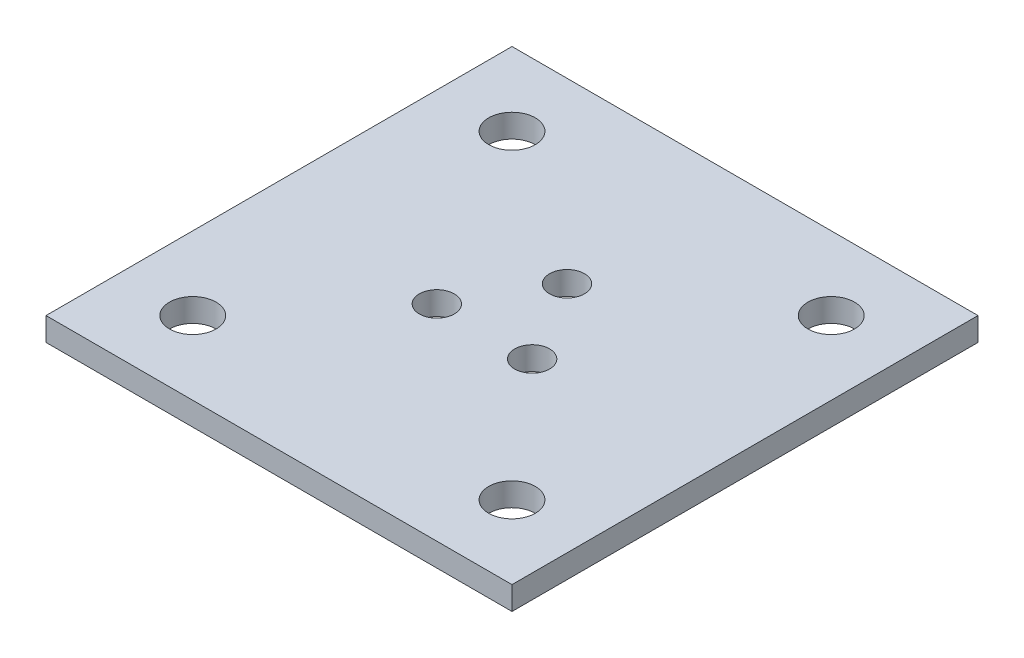
ISO-10303-21;
HEADER;
FILE_DESCRIPTION(('STEP AP214'),'2;1');
FILE_NAME('part.step','',(''),(''),'','','');
FILE_SCHEMA(('AUTOMOTIVE_DESIGN { 1 0 10303 214 1 1 1 1 }'));
ENDSEC;
DATA;
#1=APPLICATION_CONTEXT('core data for automotive mechanical design processes');
#2=APPLICATION_PROTOCOL_DEFINITION('international standard','automotive_design',2000,#1);
#3=PRODUCT_CONTEXT('',#1,'mechanical');
#4=PRODUCT('Part','Part','',(#3));
#5=PRODUCT_RELATED_PRODUCT_CATEGORY('part','',(#4));
#6=PRODUCT_DEFINITION_FORMATION('','',#4);
#7=PRODUCT_DEFINITION_CONTEXT('part definition',#1,'design');
#8=PRODUCT_DEFINITION('design','',#6,#7);
#9=PRODUCT_DEFINITION_SHAPE('','',#8);
#10=(LENGTH_UNIT() NAMED_UNIT(*) SI_UNIT(.MILLI.,.METRE.));
#11=(NAMED_UNIT(*) PLANE_ANGLE_UNIT() SI_UNIT($,.RADIAN.));
#12=(NAMED_UNIT(*) SI_UNIT($,.STERADIAN.) SOLID_ANGLE_UNIT());
#13=UNCERTAINTY_MEASURE_WITH_UNIT(LENGTH_MEASURE(1.E-05),#10,'distance_accuracy_value','');
#14=(GEOMETRIC_REPRESENTATION_CONTEXT(3) GLOBAL_UNCERTAINTY_ASSIGNED_CONTEXT((#13)) GLOBAL_UNIT_ASSIGNED_CONTEXT((#10,
#11,#12)) REPRESENTATION_CONTEXT('',''));
#15=CARTESIAN_POINT('',(0.,0.,0.));
#16=DIRECTION('',(0.,0.,1.));
#17=DIRECTION('',(1.,0.,0.));
#18=AXIS2_PLACEMENT_3D('',#15,#16,#17);
#19=CARTESIAN_POINT('',(31.75,3.175,31.75));
#20=DIRECTION('',(-1.,0.,0.));
#21=DIRECTION('',(0.,0.,1.));
#22=AXIS2_PLACEMENT_3D('',#19,#20,#21);
#23=PLANE('',#22);
#24=DIRECTION('',(0.,0.,-1.));
#25=VECTOR('',#24,1.);
#26=CARTESIAN_POINT('',(31.75,0.,31.75));
#27=LINE('',#26,#25);
#28=CARTESIAN_POINT('',(31.75,0.,31.75));
#29=VERTEX_POINT('',#28);
#30=CARTESIAN_POINT('',(31.75,0.,-31.75));
#31=VERTEX_POINT('',#30);
#32=EDGE_CURVE('E96',#29,#31,#27,.T.);
#33=ORIENTED_EDGE('',*,*,#32,.T.);
#34=DIRECTION('',(0.,-1.,0.));
#35=VECTOR('',#34,1.);
#36=CARTESIAN_POINT('',(31.75,3.175,-31.75));
#37=LINE('',#36,#35);
#38=CARTESIAN_POINT('',(31.75,3.175,-31.75));
#39=VERTEX_POINT('',#38);
#40=EDGE_CURVE('E11',#39,#31,#37,.T.);
#41=ORIENTED_EDGE('',*,*,#40,.F.);
#42=DIRECTION('',(0.,0.,-1.));
#43=VECTOR('',#42,1.);
#44=CARTESIAN_POINT('',(31.75,3.175,31.75));
#45=LINE('',#44,#43);
#46=CARTESIAN_POINT('',(31.75,3.175,31.75));
#47=VERTEX_POINT('',#46);
#48=EDGE_CURVE('E84',#47,#39,#45,.T.);
#49=ORIENTED_EDGE('',*,*,#48,.F.);
#50=DIRECTION('',(0.,-1.,0.));
#51=VECTOR('',#50,1.);
#52=CARTESIAN_POINT('',(31.75,3.175,31.75));
#53=LINE('',#52,#51);
#54=EDGE_CURVE('E92',#47,#29,#53,.T.);
#55=ORIENTED_EDGE('',*,*,#54,.T.);
#56=EDGE_LOOP('',(#33,#41,#49,#55));
#57=FACE_BOUND('',#56,.T.);
#58=ADVANCED_FACE('F33',(#57),#23,.F.);
#59=CARTESIAN_POINT('',(-31.75,3.175,-31.75));
#60=DIRECTION('',(0.,0.,1.));
#61=DIRECTION('',(1.,0.,0.));
#62=AXIS2_PLACEMENT_3D('',#59,#60,#61);
#63=PLANE('',#62);
#64=DIRECTION('',(-1.,0.,0.));
#65=VECTOR('',#64,1.);
#66=CARTESIAN_POINT('',(-31.75,0.,-31.75));
#67=LINE('',#66,#65);
#68=CARTESIAN_POINT('',(-31.75,0.,-31.75));
#69=VERTEX_POINT('',#68);
#70=EDGE_CURVE('E88',#31,#69,#67,.T.);
#71=ORIENTED_EDGE('',*,*,#70,.T.);
#72=DIRECTION('',(0.,-1.,0.));
#73=VECTOR('',#72,1.);
#74=CARTESIAN_POINT('',(-31.75,3.175,-31.75));
#75=LINE('',#74,#73);
#76=CARTESIAN_POINT('',(-31.75,3.175,-31.75));
#77=VERTEX_POINT('',#76);
#78=EDGE_CURVE('E41',#77,#69,#75,.T.);
#79=ORIENTED_EDGE('',*,*,#78,.F.);
#80=DIRECTION('',(-1.,0.,0.));
#81=VECTOR('',#80,1.);
#82=CARTESIAN_POINT('',(-31.75,3.175,-31.75));
#83=LINE('',#82,#81);
#84=EDGE_CURVE('E79',#39,#77,#83,.T.);
#85=ORIENTED_EDGE('',*,*,#84,.F.);
#86=ORIENTED_EDGE('',*,*,#40,.T.);
#87=EDGE_LOOP('',(#71,#79,#85,#86));
#88=FACE_BOUND('',#87,.T.);
#89=ADVANCED_FACE('F87',(#88),#63,.F.);
#90=CARTESIAN_POINT('',(-31.75,3.175,31.75));
#91=DIRECTION('',(1.,0.,0.));
#92=DIRECTION('',(0.,0.,-1.));
#93=AXIS2_PLACEMENT_3D('',#90,#91,#92);
#94=PLANE('',#93);
#95=DIRECTION('',(0.,0.,1.));
#96=VECTOR('',#95,1.);
#97=CARTESIAN_POINT('',(-31.75,0.,31.75));
#98=LINE('',#97,#96);
#99=CARTESIAN_POINT('',(-31.75,0.,31.75));
#100=VERTEX_POINT('',#99);
#101=EDGE_CURVE('E66',#69,#100,#98,.T.);
#102=ORIENTED_EDGE('',*,*,#101,.T.);
#103=DIRECTION('',(0.,-1.,0.));
#104=VECTOR('',#103,1.);
#105=CARTESIAN_POINT('',(-31.75,3.175,31.75));
#106=LINE('',#105,#104);
#107=CARTESIAN_POINT('',(-31.75,3.175,31.75));
#108=VERTEX_POINT('',#107);
#109=EDGE_CURVE('E89',#108,#100,#106,.T.);
#110=ORIENTED_EDGE('',*,*,#109,.F.);
#111=DIRECTION('',(0.,0.,1.));
#112=VECTOR('',#111,1.);
#113=CARTESIAN_POINT('',(-31.75,3.175,31.75));
#114=LINE('',#113,#112);
#115=EDGE_CURVE('E82',#77,#108,#114,.T.);
#116=ORIENTED_EDGE('',*,*,#115,.F.);
#117=ORIENTED_EDGE('',*,*,#78,.T.);
#118=EDGE_LOOP('',(#102,#110,#116,#117));
#119=FACE_BOUND('',#118,.T.);
#120=ADVANCED_FACE('F90',(#119),#94,.F.);
#121=CARTESIAN_POINT('',(-31.75,3.175,31.75));
#122=DIRECTION('',(0.,0.,-1.));
#123=DIRECTION('',(-1.,0.,0.));
#124=AXIS2_PLACEMENT_3D('',#121,#122,#123);
#125=PLANE('',#124);
#126=DIRECTION('',(1.,0.,0.));
#127=VECTOR('',#126,1.);
#128=CARTESIAN_POINT('',(-31.75,0.,31.75));
#129=LINE('',#128,#127);
#130=EDGE_CURVE('E72',#100,#29,#129,.T.);
#131=ORIENTED_EDGE('',*,*,#130,.T.);
#132=ORIENTED_EDGE('',*,*,#54,.F.);
#133=DIRECTION('',(1.,0.,0.));
#134=VECTOR('',#133,1.);
#135=CARTESIAN_POINT('',(-31.75,3.175,31.75));
#136=LINE('',#135,#134);
#137=EDGE_CURVE('E49',#108,#47,#136,.T.);
#138=ORIENTED_EDGE('',*,*,#137,.F.);
#139=ORIENTED_EDGE('',*,*,#109,.T.);
#140=EDGE_LOOP('',(#131,#132,#138,#139));
#141=FACE_BOUND('',#140,.T.);
#142=ADVANCED_FACE('F104',(#141),#125,.F.);
#143=CARTESIAN_POINT('',(0.,3.175,0.));
#144=DIRECTION('',(0.,-1.,0.));
#145=DIRECTION('',(0.,0.,-1.));
#146=AXIS2_PLACEMENT_3D('',#143,#144,#145);
#147=PLANE('',#146);
#148=CARTESIAN_POINT('',(21.75,3.175,-21.75));
#149=DIRECTION('',(0.,1.,0.));
#150=DIRECTION('',(0.,0.,1.));
#151=AXIS2_PLACEMENT_3D('',#148,#149,#150);
#152=CIRCLE('',#151,3.175);
#153=CARTESIAN_POINT('',(21.75,3.175,-18.575));
#154=VERTEX_POINT('',#153);
#155=EDGE_CURVE('E134',#154,#154,#152,.T.);
#156=ORIENTED_EDGE('',*,*,#155,.F.);
#157=EDGE_LOOP('',(#156));
#158=FACE_BOUND('',#157,.T.);
#159=CARTESIAN_POINT('',(21.75,3.175,21.75));
#160=DIRECTION('',(0.,1.,0.));
#161=DIRECTION('',(0.,0.,1.));
#162=AXIS2_PLACEMENT_3D('',#159,#160,#161);
#163=CIRCLE('',#162,3.175);
#164=CARTESIAN_POINT('',(21.75,3.175,24.925));
#165=VERTEX_POINT('',#164);
#166=EDGE_CURVE('E140',#165,#165,#163,.T.);
#167=ORIENTED_EDGE('',*,*,#166,.F.);
#168=EDGE_LOOP('',(#167));
#169=FACE_BOUND('',#168,.T.);
#170=CARTESIAN_POINT('',(-21.75,3.175,21.75));
#171=DIRECTION('',(0.,1.,0.));
#172=DIRECTION('',(0.,0.,1.));
#173=AXIS2_PLACEMENT_3D('',#170,#171,#172);
#174=CIRCLE('',#173,3.175);
#175=CARTESIAN_POINT('',(-21.75,3.175,24.925));
#176=VERTEX_POINT('',#175);
#177=EDGE_CURVE('E146',#176,#176,#174,.T.);
#178=ORIENTED_EDGE('',*,*,#177,.F.);
#179=EDGE_LOOP('',(#178));
#180=FACE_BOUND('',#179,.T.);
#181=CARTESIAN_POINT('',(-21.75,3.175,-21.75));
#182=DIRECTION('',(0.,1.,0.));
#183=DIRECTION('',(0.,0.,1.));
#184=AXIS2_PLACEMENT_3D('',#181,#182,#183);
#185=CIRCLE('',#184,3.175);
#186=CARTESIAN_POINT('',(-21.75,3.175,-18.575));
#187=VERTEX_POINT('',#186);
#188=EDGE_CURVE('E128',#187,#187,#185,.T.);
#189=ORIENTED_EDGE('',*,*,#188,.F.);
#190=EDGE_LOOP('',(#189));
#191=FACE_BOUND('',#190,.T.);
#192=CARTESIAN_POINT('',(0.,3.175,-7.5));
#193=DIRECTION('',(0.,1.,0.));
#194=DIRECTION('',(0.,0.,1.));
#195=AXIS2_PLACEMENT_3D('',#192,#193,#194);
#196=CIRCLE('',#195,2.38125);
#197=CARTESIAN_POINT('',(0.,3.175,-5.11875));
#198=VERTEX_POINT('',#197);
#199=EDGE_CURVE('E123',#198,#198,#196,.T.);
#200=ORIENTED_EDGE('',*,*,#199,.F.);
#201=EDGE_LOOP('',(#200));
#202=FACE_BOUND('',#201,.T.);
#203=CARTESIAN_POINT('',(-6.49519052838272,3.175,3.75000000000033));
#204=DIRECTION('',(0.,1.,0.));
#205=DIRECTION('',(0.,0.,1.));
#206=AXIS2_PLACEMENT_3D('',#203,#204,#205);
#207=CIRCLE('',#206,2.38125);
#208=CARTESIAN_POINT('',(-6.49519052838272,3.175,6.13125000000033));
#209=VERTEX_POINT('',#208);
#210=EDGE_CURVE('E120',#209,#209,#207,.T.);
#211=ORIENTED_EDGE('',*,*,#210,.F.);
#212=EDGE_LOOP('',(#211));
#213=FACE_BOUND('',#212,.T.);
#214=CARTESIAN_POINT('',(6.49519052838386,3.175,3.74999999999966));
#215=DIRECTION('',(0.,1.,0.));
#216=DIRECTION('',(0.,0.,1.));
#217=AXIS2_PLACEMENT_3D('',#214,#215,#216);
#218=CIRCLE('',#217,2.38125);
#219=CARTESIAN_POINT('',(6.49519052838386,3.175,6.13124999999966));
#220=VERTEX_POINT('',#219);
#221=EDGE_CURVE('E113',#220,#220,#218,.T.);
#222=ORIENTED_EDGE('',*,*,#221,.F.);
#223=EDGE_LOOP('',(#222));
#224=FACE_BOUND('',#223,.T.);
#225=ORIENTED_EDGE('',*,*,#48,.T.);
#226=ORIENTED_EDGE('',*,*,#84,.T.);
#227=ORIENTED_EDGE('',*,*,#115,.T.);
#228=ORIENTED_EDGE('',*,*,#137,.T.);
#229=EDGE_LOOP('',(#225,#226,#227,#228));
#230=FACE_BOUND('',#229,.T.);
#231=ADVANCED_FACE('F80',(#158,#169,#180,#191,#202,#213,#224,#230),#147,.F.);
#232=CARTESIAN_POINT('',(0.,0.,0.));
#233=DIRECTION('',(0.,-1.,0.));
#234=DIRECTION('',(0.,0.,-1.));
#235=AXIS2_PLACEMENT_3D('',#232,#233,#234);
#236=PLANE('',#235);
#237=CARTESIAN_POINT('',(21.75,0.,-21.75));
#238=DIRECTION('',(0.,1.,0.));
#239=DIRECTION('',(0.,0.,1.));
#240=AXIS2_PLACEMENT_3D('',#237,#238,#239);
#241=CIRCLE('',#240,3.175);
#242=CARTESIAN_POINT('',(21.75,0.,-18.575));
#243=VERTEX_POINT('',#242);
#244=EDGE_CURVE('E137',#243,#243,#241,.T.);
#245=ORIENTED_EDGE('',*,*,#244,.T.);
#246=EDGE_LOOP('',(#245));
#247=FACE_BOUND('',#246,.T.);
#248=CARTESIAN_POINT('',(21.75,0.,21.75));
#249=DIRECTION('',(0.,1.,0.));
#250=DIRECTION('',(0.,0.,1.));
#251=AXIS2_PLACEMENT_3D('',#248,#249,#250);
#252=CIRCLE('',#251,3.175);
#253=CARTESIAN_POINT('',(21.75,0.,24.925));
#254=VERTEX_POINT('',#253);
#255=EDGE_CURVE('E143',#254,#254,#252,.T.);
#256=ORIENTED_EDGE('',*,*,#255,.T.);
#257=EDGE_LOOP('',(#256));
#258=FACE_BOUND('',#257,.T.);
#259=CARTESIAN_POINT('',(-21.75,0.,21.75));
#260=DIRECTION('',(0.,1.,0.));
#261=DIRECTION('',(0.,0.,1.));
#262=AXIS2_PLACEMENT_3D('',#259,#260,#261);
#263=CIRCLE('',#262,3.175);
#264=CARTESIAN_POINT('',(-21.75,0.,24.925));
#265=VERTEX_POINT('',#264);
#266=EDGE_CURVE('E131',#265,#265,#263,.T.);
#267=ORIENTED_EDGE('',*,*,#266,.T.);
#268=EDGE_LOOP('',(#267));
#269=FACE_BOUND('',#268,.T.);
#270=CARTESIAN_POINT('',(-21.75,0.,-21.75));
#271=DIRECTION('',(0.,1.,0.));
#272=DIRECTION('',(0.,0.,1.));
#273=AXIS2_PLACEMENT_3D('',#270,#271,#272);
#274=CIRCLE('',#273,3.175);
#275=CARTESIAN_POINT('',(-21.75,0.,-18.575));
#276=VERTEX_POINT('',#275);
#277=EDGE_CURVE('E114',#276,#276,#274,.T.);
#278=ORIENTED_EDGE('',*,*,#277,.T.);
#279=EDGE_LOOP('',(#278));
#280=FACE_BOUND('',#279,.T.);
#281=CARTESIAN_POINT('',(0.,0.,-7.5));
#282=DIRECTION('',(0.,1.,0.));
#283=DIRECTION('',(0.,0.,1.));
#284=AXIS2_PLACEMENT_3D('',#281,#282,#283);
#285=CIRCLE('',#284,2.38125);
#286=CARTESIAN_POINT('',(0.,0.,-5.11875));
#287=VERTEX_POINT('',#286);
#288=EDGE_CURVE('E99',#287,#287,#285,.T.);
#289=ORIENTED_EDGE('',*,*,#288,.T.);
#290=EDGE_LOOP('',(#289));
#291=FACE_BOUND('',#290,.T.);
#292=CARTESIAN_POINT('',(-6.49519052838272,0.,3.75000000000033));
#293=DIRECTION('',(0.,1.,0.));
#294=DIRECTION('',(0.,0.,1.));
#295=AXIS2_PLACEMENT_3D('',#292,#293,#294);
#296=CIRCLE('',#295,2.38125);
#297=CARTESIAN_POINT('',(-6.49519052838272,0.,6.13125000000033));
#298=VERTEX_POINT('',#297);
#299=EDGE_CURVE('E117',#298,#298,#296,.T.);
#300=ORIENTED_EDGE('',*,*,#299,.T.);
#301=EDGE_LOOP('',(#300));
#302=FACE_BOUND('',#301,.T.);
#303=CARTESIAN_POINT('',(6.49519052838386,0.,3.74999999999966));
#304=DIRECTION('',(0.,1.,0.));
#305=DIRECTION('',(0.,0.,1.));
#306=AXIS2_PLACEMENT_3D('',#303,#304,#305);
#307=CIRCLE('',#306,2.38125);
#308=CARTESIAN_POINT('',(6.49519052838386,0.,6.13124999999966));
#309=VERTEX_POINT('',#308);
#310=EDGE_CURVE('E110',#309,#309,#307,.T.);
#311=ORIENTED_EDGE('',*,*,#310,.T.);
#312=EDGE_LOOP('',(#311));
#313=FACE_BOUND('',#312,.T.);
#314=ORIENTED_EDGE('',*,*,#32,.F.);
#315=ORIENTED_EDGE('',*,*,#130,.F.);
#316=ORIENTED_EDGE('',*,*,#101,.F.);
#317=ORIENTED_EDGE('',*,*,#70,.F.);
#318=EDGE_LOOP('',(#314,#315,#316,#317));
#319=FACE_BOUND('',#318,.T.);
#320=ADVANCED_FACE('F107',(#247,#258,#269,#280,#291,#302,#313,#319),#236,.T.);
#321=CARTESIAN_POINT('',(6.49519052838386,0.,3.74999999999966));
#322=DIRECTION('',(0.,1.,0.));
#323=DIRECTION('',(0.,0.,1.));
#324=AXIS2_PLACEMENT_3D('',#321,#322,#323);
#325=CYLINDRICAL_SURFACE('',#324,2.38125);
#326=ORIENTED_EDGE('',*,*,#310,.F.);
#327=EDGE_LOOP('',(#326));
#328=FACE_BOUND('',#327,.T.);
#329=ORIENTED_EDGE('',*,*,#221,.T.);
#330=EDGE_LOOP('',(#329));
#331=FACE_BOUND('',#330,.T.);
#332=ADVANCED_FACE('F174',(#328,#331),#325,.F.);
#333=CARTESIAN_POINT('',(-6.49519052838272,0.,3.75000000000033));
#334=DIRECTION('',(0.,1.,0.));
#335=DIRECTION('',(0.,0.,1.));
#336=AXIS2_PLACEMENT_3D('',#333,#334,#335);
#337=CYLINDRICAL_SURFACE('',#336,2.38125);
#338=ORIENTED_EDGE('',*,*,#299,.F.);
#339=EDGE_LOOP('',(#338));
#340=FACE_BOUND('',#339,.T.);
#341=ORIENTED_EDGE('',*,*,#210,.T.);
#342=EDGE_LOOP('',(#341));
#343=FACE_BOUND('',#342,.T.);
#344=ADVANCED_FACE('F176',(#340,#343),#337,.F.);
#345=CARTESIAN_POINT('',(0.,0.,-7.5));
#346=DIRECTION('',(0.,1.,0.));
#347=DIRECTION('',(0.,0.,1.));
#348=AXIS2_PLACEMENT_3D('',#345,#346,#347);
#349=CYLINDRICAL_SURFACE('',#348,2.38125);
#350=ORIENTED_EDGE('',*,*,#288,.F.);
#351=EDGE_LOOP('',(#350));
#352=FACE_BOUND('',#351,.T.);
#353=ORIENTED_EDGE('',*,*,#199,.T.);
#354=EDGE_LOOP('',(#353));
#355=FACE_BOUND('',#354,.T.);
#356=ADVANCED_FACE('F183',(#352,#355),#349,.F.);
#357=CARTESIAN_POINT('',(-21.75,0.,-21.75));
#358=DIRECTION('',(0.,1.,0.));
#359=DIRECTION('',(0.,0.,1.));
#360=AXIS2_PLACEMENT_3D('',#357,#358,#359);
#361=CYLINDRICAL_SURFACE('',#360,3.175);
#362=ORIENTED_EDGE('',*,*,#277,.F.);
#363=EDGE_LOOP('',(#362));
#364=FACE_BOUND('',#363,.T.);
#365=ORIENTED_EDGE('',*,*,#188,.T.);
#366=EDGE_LOOP('',(#365));
#367=FACE_BOUND('',#366,.T.);
#368=ADVANCED_FACE('F158',(#364,#367),#361,.F.);
#369=CARTESIAN_POINT('',(-21.75,0.,21.75));
#370=DIRECTION('',(0.,1.,0.));
#371=DIRECTION('',(0.,0.,1.));
#372=AXIS2_PLACEMENT_3D('',#369,#370,#371);
#373=CYLINDRICAL_SURFACE('',#372,3.175);
#374=ORIENTED_EDGE('',*,*,#266,.F.);
#375=EDGE_LOOP('',(#374));
#376=FACE_BOUND('',#375,.T.);
#377=ORIENTED_EDGE('',*,*,#177,.T.);
#378=EDGE_LOOP('',(#377));
#379=FACE_BOUND('',#378,.T.);
#380=ADVANCED_FACE('F154',(#376,#379),#373,.F.);
#381=CARTESIAN_POINT('',(21.75,0.,21.75));
#382=DIRECTION('',(0.,1.,0.));
#383=DIRECTION('',(0.,0.,1.));
#384=AXIS2_PLACEMENT_3D('',#381,#382,#383);
#385=CYLINDRICAL_SURFACE('',#384,3.175);
#386=ORIENTED_EDGE('',*,*,#255,.F.);
#387=EDGE_LOOP('',(#386));
#388=FACE_BOUND('',#387,.T.);
#389=ORIENTED_EDGE('',*,*,#166,.T.);
#390=EDGE_LOOP('',(#389));
#391=FACE_BOUND('',#390,.T.);
#392=ADVANCED_FACE('F157',(#388,#391),#385,.F.);
#393=CARTESIAN_POINT('',(21.75,0.,-21.75));
#394=DIRECTION('',(0.,1.,0.));
#395=DIRECTION('',(0.,0.,1.));
#396=AXIS2_PLACEMENT_3D('',#393,#394,#395);
#397=CYLINDRICAL_SURFACE('',#396,3.175);
#398=ORIENTED_EDGE('',*,*,#244,.F.);
#399=EDGE_LOOP('',(#398));
#400=FACE_BOUND('',#399,.T.);
#401=ORIENTED_EDGE('',*,*,#155,.T.);
#402=EDGE_LOOP('',(#401));
#403=FACE_BOUND('',#402,.T.);
#404=ADVANCED_FACE('F239',(#400,#403),#397,.F.);
#405=CLOSED_SHELL('',(#58,#89,#120,#142,#231,#320,#332,#344,#356,#368,#380,#392,#404));
#406=MANIFOLD_SOLID_BREP('B2',#405);
#407=ADVANCED_BREP_SHAPE_REPRESENTATION('',(#18,#406),#14);
#408=SHAPE_DEFINITION_REPRESENTATION(#9,#407);
ENDSEC;
END-ISO-10303-21;
